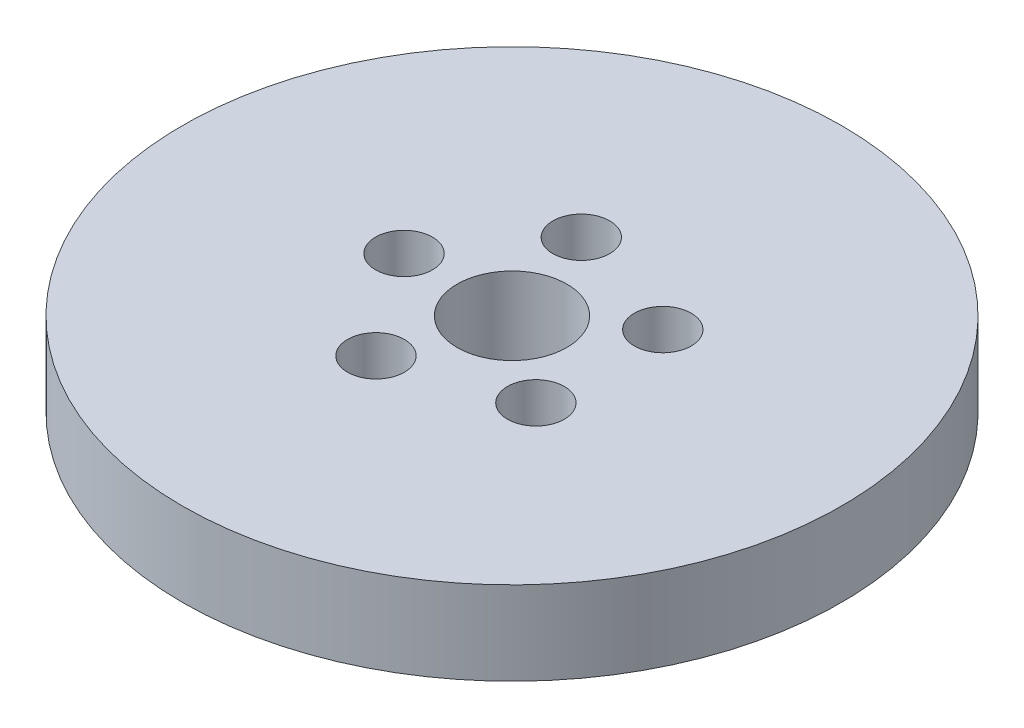
ISO-10303-21;
HEADER;
FILE_DESCRIPTION(('STEP AP214'),'2;1');
FILE_NAME('part.step','',(''),(''),'','','');
FILE_SCHEMA(('AUTOMOTIVE_DESIGN { 1 0 10303 214 1 1 1 1 }'));
ENDSEC;
DATA;
#1=APPLICATION_CONTEXT('core data for automotive mechanical design processes');
#2=APPLICATION_PROTOCOL_DEFINITION('international standard','automotive_design',2000,#1);
#3=PRODUCT_CONTEXT('',#1,'mechanical');
#4=PRODUCT('Part','Part','',(#3));
#5=PRODUCT_RELATED_PRODUCT_CATEGORY('part','',(#4));
#6=PRODUCT_DEFINITION_FORMATION('','',#4);
#7=PRODUCT_DEFINITION_CONTEXT('part definition',#1,'design');
#8=PRODUCT_DEFINITION('design','',#6,#7);
#9=PRODUCT_DEFINITION_SHAPE('','',#8);
#10=(LENGTH_UNIT() NAMED_UNIT(*) SI_UNIT(.MILLI.,.METRE.));
#11=(NAMED_UNIT(*) PLANE_ANGLE_UNIT() SI_UNIT($,.RADIAN.));
#12=(NAMED_UNIT(*) SI_UNIT($,.STERADIAN.) SOLID_ANGLE_UNIT());
#13=UNCERTAINTY_MEASURE_WITH_UNIT(LENGTH_MEASURE(1.E-05),#10,'distance_accuracy_value','');
#14=(GEOMETRIC_REPRESENTATION_CONTEXT(3) GLOBAL_UNCERTAINTY_ASSIGNED_CONTEXT((#13)) GLOBAL_UNIT_ASSIGNED_CONTEXT((#10,
#11,#12)) REPRESENTATION_CONTEXT('',''));
#15=CARTESIAN_POINT('',(0.,0.,0.));
#16=DIRECTION('',(0.,0.,1.));
#17=DIRECTION('',(1.,0.,0.));
#18=AXIS2_PLACEMENT_3D('',#15,#16,#17);
#19=CARTESIAN_POINT('',(0.,19.,0.));
#20=DIRECTION('',(0.,-1.,0.));
#21=DIRECTION('',(0.,0.,-1.));
#22=AXIS2_PLACEMENT_3D('',#19,#20,#21);
#23=CYLINDRICAL_SURFACE('',#22,75.);
#24=CARTESIAN_POINT('',(0.,19.,0.));
#25=DIRECTION('',(0.,1.,0.));
#26=DIRECTION('',(0.,0.,1.));
#27=AXIS2_PLACEMENT_3D('',#24,#25,#26);
#28=CIRCLE('',#27,75.);
#29=CARTESIAN_POINT('',(0.,19.,75.));
#30=VERTEX_POINT('',#29);
#31=EDGE_CURVE('E10',#30,#30,#28,.T.);
#32=ORIENTED_EDGE('',*,*,#31,.F.);
#33=EDGE_LOOP('',(#32));
#34=FACE_BOUND('',#33,.T.);
#35=CARTESIAN_POINT('',(0.,0.,0.));
#36=DIRECTION('',(0.,1.,0.));
#37=DIRECTION('',(0.,0.,1.));
#38=AXIS2_PLACEMENT_3D('',#35,#36,#37);
#39=CIRCLE('',#38,75.);
#40=CARTESIAN_POINT('',(0.,0.,75.));
#41=VERTEX_POINT('',#40);
#42=EDGE_CURVE('E37',#41,#41,#39,.T.);
#43=ORIENTED_EDGE('',*,*,#42,.T.);
#44=EDGE_LOOP('',(#43));
#45=FACE_BOUND('',#44,.T.);
#46=ADVANCED_FACE('F40',(#34,#45),#23,.T.);
#47=CARTESIAN_POINT('',(0.,19.,0.));
#48=DIRECTION('',(0.,1.,0.));
#49=DIRECTION('',(0.,0.,1.));
#50=AXIS2_PLACEMENT_3D('',#47,#48,#49);
#51=PLANE('',#50);
#52=CARTESIAN_POINT('',(-7.59223308032457,19.,-23.3664907617114));
#53=DIRECTION('',(0.,1.,0.));
#54=DIRECTION('',(-0.95105651629515,0.,0.309016994374958));
#55=AXIS2_PLACEMENT_3D('',#52,#53,#54);
#56=CIRCLE('',#55,6.47248801761607);
#57=CARTESIAN_POINT('',(-13.7479349861206,19.,-21.3663819683797));
#58=VERTEX_POINT('',#57);
#59=EDGE_CURVE('E70',#58,#58,#56,.T.);
#60=ORIENTED_EDGE('',*,*,#59,.F.);
#61=EDGE_LOOP('',(#60));
#62=FACE_BOUND('',#61,.T.);
#63=CARTESIAN_POINT('',(19.8767242548002,19.,-14.4412854885483));
#64=DIRECTION('',(0.,1.,0.));
#65=DIRECTION('',(-0.58778525229248,0.,-0.809016994374942));
#66=AXIS2_PLACEMENT_3D('',#63,#64,#65);
#67=CIRCLE('',#66,6.47248801761607);
#68=CARTESIAN_POINT('',(16.0722912524057,19.,-19.6776382906879));
#69=VERTEX_POINT('',#68);
#70=EDGE_CURVE('E71',#69,#69,#67,.T.);
#71=ORIENTED_EDGE('',*,*,#70,.F.);
#72=EDGE_LOOP('',(#71));
#73=FACE_BOUND('',#72,.T.);
#74=CARTESIAN_POINT('',(19.8767242548004,19.,14.441285488548));
#75=DIRECTION('',(0.,1.,0.));
#76=DIRECTION('',(0.587785252292469,0.,-0.809016994374951));
#77=AXIS2_PLACEMENT_3D('',#74,#75,#76);
#78=CIRCLE('',#77,6.47248801761607);
#79=CARTESIAN_POINT('',(23.6811572571949,19.,9.20493268640837));
#80=VERTEX_POINT('',#79);
#81=EDGE_CURVE('E78',#80,#80,#78,.T.);
#82=ORIENTED_EDGE('',*,*,#81,.F.);
#83=EDGE_LOOP('',(#82));
#84=FACE_BOUND('',#83,.T.);
#85=CARTESIAN_POINT('',(-7.59223308032424,19.,23.3664907617115));
#86=DIRECTION('',(0.,1.,0.));
#87=DIRECTION('',(0.951056516295155,0.,0.309016994374945));
#88=AXIS2_PLACEMENT_3D('',#85,#86,#87);
#89=CIRCLE('',#88,6.47248801761607);
#90=CARTESIAN_POINT('',(-1.43653117452817,19.,25.3665995550431));
#91=VERTEX_POINT('',#90);
#92=EDGE_CURVE('E61',#91,#91,#89,.T.);
#93=ORIENTED_EDGE('',*,*,#92,.F.);
#94=EDGE_LOOP('',(#93));
#95=FACE_BOUND('',#94,.T.);
#96=CARTESIAN_POINT('',(-24.5689823489521,19.,0.));
#97=DIRECTION('',(0.,1.,0.));
#98=DIRECTION('',(0.,0.,1.));
#99=AXIS2_PLACEMENT_3D('',#96,#97,#98);
#100=CIRCLE('',#99,6.47248801761607);
#101=CARTESIAN_POINT('',(-24.5689823489521,19.,6.47248801761607));
#102=VERTEX_POINT('',#101);
#103=EDGE_CURVE('E54',#102,#102,#100,.T.);
#104=ORIENTED_EDGE('',*,*,#103,.F.);
#105=EDGE_LOOP('',(#104));
#106=FACE_BOUND('',#105,.T.);
#107=CARTESIAN_POINT('',(0.,19.,0.));
#108=DIRECTION('',(0.,1.,0.));
#109=DIRECTION('',(0.,0.,1.));
#110=AXIS2_PLACEMENT_3D('',#107,#108,#109);
#111=CIRCLE('',#110,12.5);
#112=CARTESIAN_POINT('',(0.,19.,12.5));
#113=VERTEX_POINT('',#112);
#114=EDGE_CURVE('E50',#113,#113,#111,.T.);
#115=ORIENTED_EDGE('',*,*,#114,.F.);
#116=EDGE_LOOP('',(#115));
#117=FACE_BOUND('',#116,.T.);
#118=ORIENTED_EDGE('',*,*,#31,.T.);
#119=EDGE_LOOP('',(#118));
#120=FACE_BOUND('',#119,.T.);
#121=ADVANCED_FACE('F94',(#62,#73,#84,#95,#106,#117,#120),#51,.T.);
#122=CARTESIAN_POINT('',(0.,0.,0.));
#123=DIRECTION('',(0.,1.,0.));
#124=DIRECTION('',(0.,0.,1.));
#125=AXIS2_PLACEMENT_3D('',#122,#123,#124);
#126=PLANE('',#125);
#127=CARTESIAN_POINT('',(0.,0.,0.));
#128=DIRECTION('',(0.,1.,0.));
#129=DIRECTION('',(0.,0.,1.));
#130=AXIS2_PLACEMENT_3D('',#127,#128,#129);
#131=CIRCLE('',#130,12.5);
#132=CARTESIAN_POINT('',(0.,0.,12.5));
#133=VERTEX_POINT('',#132);
#134=EDGE_CURVE('E47',#133,#133,#131,.T.);
#135=ORIENTED_EDGE('',*,*,#134,.T.);
#136=EDGE_LOOP('',(#135));
#137=FACE_BOUND('',#136,.T.);
#138=ORIENTED_EDGE('',*,*,#42,.F.);
#139=EDGE_LOOP('',(#138));
#140=FACE_BOUND('',#139,.T.);
#141=ADVANCED_FACE('F100',(#137,#140),#126,.F.);
#142=CARTESIAN_POINT('',(0.,19.,0.));
#143=DIRECTION('',(0.,-1.,0.));
#144=DIRECTION('',(0.,0.,-1.));
#145=AXIS2_PLACEMENT_3D('',#142,#143,#144);
#146=CYLINDRICAL_SURFACE('',#145,12.5);
#147=ORIENTED_EDGE('',*,*,#114,.T.);
#148=EDGE_LOOP('',(#147));
#149=FACE_BOUND('',#148,.T.);
#150=ORIENTED_EDGE('',*,*,#134,.F.);
#151=EDGE_LOOP('',(#150));
#152=FACE_BOUND('',#151,.T.);
#153=ADVANCED_FACE('F106',(#149,#152),#146,.F.);
#154=CARTESIAN_POINT('',(-24.5689823489521,0.705487770420819,0.));
#155=DIRECTION('',(0.,1.,0.));
#156=DIRECTION('',(0.,0.,1.));
#157=AXIS2_PLACEMENT_3D('',#154,#155,#156);
#158=CYLINDRICAL_SURFACE('',#157,6.47248801761607);
#159=CARTESIAN_POINT('',(-24.5689823489521,0.705487770420819,0.));
#160=DIRECTION('',(0.,1.,0.));
#161=DIRECTION('',(0.,0.,1.));
#162=AXIS2_PLACEMENT_3D('',#159,#160,#161);
#163=CIRCLE('',#162,6.47248801761607);
#164=CARTESIAN_POINT('',(-24.5689823489521,0.705487770420819,6.47248801761607));
#165=VERTEX_POINT('',#164);
#166=EDGE_CURVE('E55',#165,#165,#163,.T.);
#167=ORIENTED_EDGE('',*,*,#166,.F.);
#168=EDGE_LOOP('',(#167));
#169=FACE_BOUND('',#168,.T.);
#170=ORIENTED_EDGE('',*,*,#103,.T.);
#171=EDGE_LOOP('',(#170));
#172=FACE_BOUND('',#171,.T.);
#173=ADVANCED_FACE('F108',(#169,#172),#158,.F.);
#174=CARTESIAN_POINT('',(-24.5689823489521,0.705487770420819,0.));
#175=DIRECTION('',(0.,1.,0.));
#176=DIRECTION('',(0.,0.,1.));
#177=AXIS2_PLACEMENT_3D('',#174,#175,#176);
#178=PLANE('',#177);
#179=ORIENTED_EDGE('',*,*,#166,.T.);
#180=EDGE_LOOP('',(#179));
#181=FACE_BOUND('',#180,.T.);
#182=ADVANCED_FACE('F138',(#181),#178,.T.);
#183=CARTESIAN_POINT('',(-7.59223308032424,0.705487770420819,23.3664907617115));
#184=DIRECTION('',(0.,1.,0.));
#185=DIRECTION('',(0.,0.,1.));
#186=AXIS2_PLACEMENT_3D('',#183,#184,#185);
#187=CYLINDRICAL_SURFACE('',#186,6.47248801761607);
#188=CARTESIAN_POINT('',(-7.59223308032424,0.705487770420819,23.3664907617115));
#189=DIRECTION('',(0.,1.,0.));
#190=DIRECTION('',(0.951056516295155,0.,0.309016994374945));
#191=AXIS2_PLACEMENT_3D('',#188,#189,#190);
#192=CIRCLE('',#191,6.47248801761607);
#193=CARTESIAN_POINT('',(-1.43653117452817,0.705487770420819,25.3665995550431));
#194=VERTEX_POINT('',#193);
#195=EDGE_CURVE('E59',#194,#194,#192,.T.);
#196=ORIENTED_EDGE('',*,*,#195,.F.);
#197=EDGE_LOOP('',(#196));
#198=FACE_BOUND('',#197,.T.);
#199=ORIENTED_EDGE('',*,*,#92,.T.);
#200=EDGE_LOOP('',(#199));
#201=FACE_BOUND('',#200,.T.);
#202=ADVANCED_FACE('F150',(#198,#201),#187,.F.);
#203=CARTESIAN_POINT('',(-7.59223308032424,0.705487770420819,23.3664907617115));
#204=DIRECTION('',(0.,1.,0.));
#205=DIRECTION('',(0.951056516295155,0.,0.309016994374945));
#206=AXIS2_PLACEMENT_3D('',#203,#204,#205);
#207=PLANE('',#206);
#208=ORIENTED_EDGE('',*,*,#195,.T.);
#209=EDGE_LOOP('',(#208));
#210=FACE_BOUND('',#209,.T.);
#211=ADVANCED_FACE('F89',(#210),#207,.T.);
#212=CARTESIAN_POINT('',(19.8767242548004,0.705487770420819,14.441285488548));
#213=DIRECTION('',(0.,1.,0.));
#214=DIRECTION('',(0.,0.,1.));
#215=AXIS2_PLACEMENT_3D('',#212,#213,#214);
#216=CYLINDRICAL_SURFACE('',#215,6.47248801761607);
#217=CARTESIAN_POINT('',(19.8767242548004,0.705487770420819,14.441285488548));
#218=DIRECTION('',(0.,1.,0.));
#219=DIRECTION('',(0.587785252292469,0.,-0.809016994374951));
#220=AXIS2_PLACEMENT_3D('',#217,#218,#219);
#221=CIRCLE('',#220,6.47248801761607);
#222=CARTESIAN_POINT('',(23.6811572571949,0.705487770420819,9.20493268640837));
#223=VERTEX_POINT('',#222);
#224=EDGE_CURVE('E63',#223,#223,#221,.T.);
#225=ORIENTED_EDGE('',*,*,#224,.F.);
#226=EDGE_LOOP('',(#225));
#227=FACE_BOUND('',#226,.T.);
#228=ORIENTED_EDGE('',*,*,#81,.T.);
#229=EDGE_LOOP('',(#228));
#230=FACE_BOUND('',#229,.T.);
#231=ADVANCED_FACE('F87',(#227,#230),#216,.F.);
#232=CARTESIAN_POINT('',(19.8767242548004,0.705487770420819,14.441285488548));
#233=DIRECTION('',(0.,1.,0.));
#234=DIRECTION('',(0.587785252292469,0.,-0.809016994374951));
#235=AXIS2_PLACEMENT_3D('',#232,#233,#234);
#236=PLANE('',#235);
#237=ORIENTED_EDGE('',*,*,#224,.T.);
#238=EDGE_LOOP('',(#237));
#239=FACE_BOUND('',#238,.T.);
#240=ADVANCED_FACE('F84',(#239),#236,.T.);
#241=CARTESIAN_POINT('',(19.8767242548002,0.705487770420819,-14.4412854885483));
#242=DIRECTION('',(0.,1.,0.));
#243=DIRECTION('',(0.,0.,1.));
#244=AXIS2_PLACEMENT_3D('',#241,#242,#243);
#245=CYLINDRICAL_SURFACE('',#244,6.47248801761607);
#246=CARTESIAN_POINT('',(19.8767242548002,0.705487770420819,-14.4412854885483));
#247=DIRECTION('',(0.,1.,0.));
#248=DIRECTION('',(-0.58778525229248,0.,-0.809016994374942));
#249=AXIS2_PLACEMENT_3D('',#246,#247,#248);
#250=CIRCLE('',#249,6.47248801761607);
#251=CARTESIAN_POINT('',(16.0722912524057,0.705487770420819,-19.6776382906879));
#252=VERTEX_POINT('',#251);
#253=EDGE_CURVE('E76',#252,#252,#250,.T.);
#254=ORIENTED_EDGE('',*,*,#253,.F.);
#255=EDGE_LOOP('',(#254));
#256=FACE_BOUND('',#255,.T.);
#257=ORIENTED_EDGE('',*,*,#70,.T.);
#258=EDGE_LOOP('',(#257));
#259=FACE_BOUND('',#258,.T.);
#260=ADVANCED_FACE('F185',(#256,#259),#245,.F.);
#261=CARTESIAN_POINT('',(19.8767242548002,0.705487770420819,-14.4412854885483));
#262=DIRECTION('',(0.,1.,0.));
#263=DIRECTION('',(-0.58778525229248,0.,-0.809016994374942));
#264=AXIS2_PLACEMENT_3D('',#261,#262,#263);
#265=PLANE('',#264);
#266=ORIENTED_EDGE('',*,*,#253,.T.);
#267=EDGE_LOOP('',(#266));
#268=FACE_BOUND('',#267,.T.);
#269=ADVANCED_FACE('F189',(#268),#265,.T.);
#270=CARTESIAN_POINT('',(-7.59223308032457,0.705487770420819,-23.3664907617114));
#271=DIRECTION('',(0.,1.,0.));
#272=DIRECTION('',(0.,0.,1.));
#273=AXIS2_PLACEMENT_3D('',#270,#271,#272);
#274=CYLINDRICAL_SURFACE('',#273,6.47248801761607);
#275=CARTESIAN_POINT('',(-7.59223308032457,0.705487770420819,-23.3664907617114));
#276=DIRECTION('',(0.,1.,0.));
#277=DIRECTION('',(-0.95105651629515,0.,0.309016994374958));
#278=AXIS2_PLACEMENT_3D('',#275,#276,#277);
#279=CIRCLE('',#278,6.47248801761607);
#280=CARTESIAN_POINT('',(-13.7479349861206,0.705487770420819,-21.3663819683797));
#281=VERTEX_POINT('',#280);
#282=EDGE_CURVE('E69',#281,#281,#279,.T.);
#283=ORIENTED_EDGE('',*,*,#282,.F.);
#284=EDGE_LOOP('',(#283));
#285=FACE_BOUND('',#284,.T.);
#286=ORIENTED_EDGE('',*,*,#59,.T.);
#287=EDGE_LOOP('',(#286));
#288=FACE_BOUND('',#287,.T.);
#289=ADVANCED_FACE('F200',(#285,#288),#274,.F.);
#290=CARTESIAN_POINT('',(-7.59223308032457,0.705487770420819,-23.3664907617114));
#291=DIRECTION('',(0.,1.,0.));
#292=DIRECTION('',(-0.95105651629515,0.,0.309016994374958));
#293=AXIS2_PLACEMENT_3D('',#290,#291,#292);
#294=PLANE('',#293);
#295=ORIENTED_EDGE('',*,*,#282,.T.);
#296=EDGE_LOOP('',(#295));
#297=FACE_BOUND('',#296,.T.);
#298=ADVANCED_FACE('F208',(#297),#294,.T.);
#299=CLOSED_SHELL('',(#46,#121,#141,#153,#173,#182,#202,#211,#231,#240,#260,#269,#289,#298));
#300=MANIFOLD_SOLID_BREP('B2',#299);
#301=ADVANCED_BREP_SHAPE_REPRESENTATION('',(#18,#300),#14);
#302=SHAPE_DEFINITION_REPRESENTATION(#9,#301);
ENDSEC;
END-ISO-10303-21;
